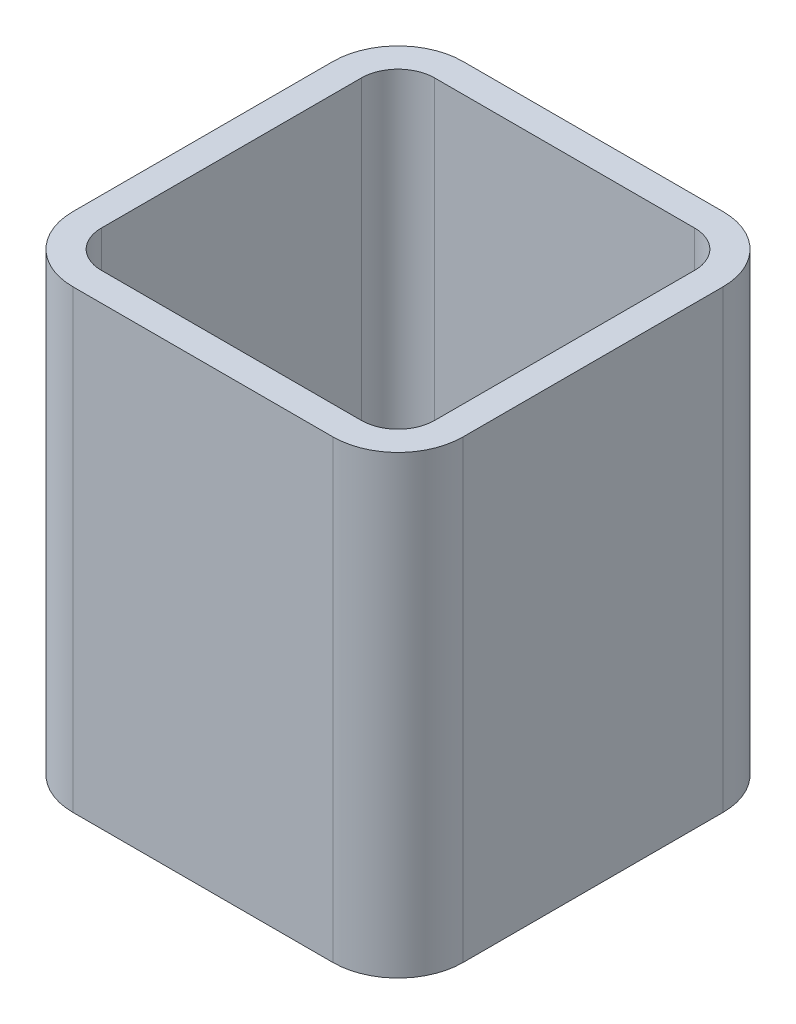
ISO-10303-21;
HEADER;
FILE_DESCRIPTION(('STEP AP214'),'2;1');
FILE_NAME('part.step','',(''),(''),'','','');
FILE_SCHEMA(('AUTOMOTIVE_DESIGN { 1 0 10303 214 1 1 1 1 }'));
ENDSEC;
DATA;
#1=APPLICATION_CONTEXT('core data for automotive mechanical design processes');
#2=APPLICATION_PROTOCOL_DEFINITION('international standard','automotive_design',2000,#1);
#3=PRODUCT_CONTEXT('',#1,'mechanical');
#4=PRODUCT('Part','Part','',(#3));
#5=PRODUCT_RELATED_PRODUCT_CATEGORY('part','',(#4));
#6=PRODUCT_DEFINITION_FORMATION('','',#4);
#7=PRODUCT_DEFINITION_CONTEXT('part definition',#1,'design');
#8=PRODUCT_DEFINITION('design','',#6,#7);
#9=PRODUCT_DEFINITION_SHAPE('','',#8);
#10=(LENGTH_UNIT() NAMED_UNIT(*) SI_UNIT(.MILLI.,.METRE.));
#11=(NAMED_UNIT(*) PLANE_ANGLE_UNIT() SI_UNIT($,.RADIAN.));
#12=(NAMED_UNIT(*) SI_UNIT($,.STERADIAN.) SOLID_ANGLE_UNIT());
#13=UNCERTAINTY_MEASURE_WITH_UNIT(LENGTH_MEASURE(1.E-05),#10,'distance_accuracy_value','');
#14=(GEOMETRIC_REPRESENTATION_CONTEXT(3) GLOBAL_UNCERTAINTY_ASSIGNED_CONTEXT((#13)) GLOBAL_UNIT_ASSIGNED_CONTEXT((#10,
#11,#12)) REPRESENTATION_CONTEXT('',''));
#15=CARTESIAN_POINT('',(0.,0.,0.));
#16=DIRECTION('',(0.,0.,1.));
#17=DIRECTION('',(1.,0.,0.));
#18=AXIS2_PLACEMENT_3D('',#15,#16,#17);
#19=CARTESIAN_POINT('',(101.6,355.6,-101.6));
#20=DIRECTION('',(0.,1.,0.));
#21=DIRECTION('',(0.,0.,1.));
#22=AXIS2_PLACEMENT_3D('',#19,#20,#21);
#23=PLANE('',#22);
#24=CARTESIAN_POINT('',(101.6,355.6,-101.6));
#25=DIRECTION('',(0.,1.,0.));
#26=DIRECTION('',(0.,0.,-1.));
#27=AXIS2_PLACEMENT_3D('',#24,#25,#26);
#28=CIRCLE('',#27,50.8);
#29=CARTESIAN_POINT('',(152.4,355.6,-101.6));
#30=VERTEX_POINT('',#29);
#31=CARTESIAN_POINT('',(101.6,355.6,-152.4));
#32=VERTEX_POINT('',#31);
#33=EDGE_CURVE('E290',#30,#32,#28,.T.);
#34=ORIENTED_EDGE('',*,*,#33,.T.);
#35=DIRECTION('',(-1.,0.,0.));
#36=VECTOR('',#35,1.);
#37=CARTESIAN_POINT('',(-101.6,355.6,-152.4));
#38=LINE('',#37,#36);
#39=CARTESIAN_POINT('',(-101.6,355.6,-152.4));
#40=VERTEX_POINT('',#39);
#41=EDGE_CURVE('E294',#32,#40,#38,.T.);
#42=ORIENTED_EDGE('',*,*,#41,.T.);
#43=CARTESIAN_POINT('',(-101.6,355.6,-101.6));
#44=DIRECTION('',(0.,1.,0.));
#45=DIRECTION('',(0.,0.,1.));
#46=AXIS2_PLACEMENT_3D('',#43,#44,#45);
#47=CIRCLE('',#46,50.8);
#48=CARTESIAN_POINT('',(-152.4,355.6,-101.6));
#49=VERTEX_POINT('',#48);
#50=EDGE_CURVE('E298',#40,#49,#47,.T.);
#51=ORIENTED_EDGE('',*,*,#50,.T.);
#52=DIRECTION('',(0.,0.,1.));
#53=VECTOR('',#52,1.);
#54=CARTESIAN_POINT('',(-152.4,355.6,-101.6));
#55=LINE('',#54,#53);
#56=CARTESIAN_POINT('',(-152.4,355.6,101.6));
#57=VERTEX_POINT('',#56);
#58=EDGE_CURVE('E301',#49,#57,#55,.T.);
#59=ORIENTED_EDGE('',*,*,#58,.T.);
#60=CARTESIAN_POINT('',(-101.6,355.6,101.6));
#61=DIRECTION('',(0.,1.,0.));
#62=DIRECTION('',(0.,0.,1.));
#63=AXIS2_PLACEMENT_3D('',#60,#61,#62);
#64=CIRCLE('',#63,50.8);
#65=CARTESIAN_POINT('',(-101.6,355.6,152.4));
#66=VERTEX_POINT('',#65);
#67=EDGE_CURVE('E304',#57,#66,#64,.T.);
#68=ORIENTED_EDGE('',*,*,#67,.T.);
#69=DIRECTION('',(1.,0.,0.));
#70=VECTOR('',#69,1.);
#71=CARTESIAN_POINT('',(-101.6,355.6,152.4));
#72=LINE('',#71,#70);
#73=CARTESIAN_POINT('',(101.6,355.6,152.4));
#74=VERTEX_POINT('',#73);
#75=EDGE_CURVE('E307',#66,#74,#72,.T.);
#76=ORIENTED_EDGE('',*,*,#75,.T.);
#77=CARTESIAN_POINT('',(101.6,355.6,101.6));
#78=DIRECTION('',(0.,1.,0.));
#79=DIRECTION('',(0.,0.,1.));
#80=AXIS2_PLACEMENT_3D('',#77,#78,#79);
#81=CIRCLE('',#80,50.8);
#82=CARTESIAN_POINT('',(152.4,355.6,101.6));
#83=VERTEX_POINT('',#82);
#84=EDGE_CURVE('E310',#74,#83,#81,.T.);
#85=ORIENTED_EDGE('',*,*,#84,.T.);
#86=DIRECTION('',(0.,0.,-1.));
#87=VECTOR('',#86,1.);
#88=CARTESIAN_POINT('',(152.4,355.6,-101.6));
#89=LINE('',#88,#87);
#90=EDGE_CURVE('E313',#83,#30,#89,.T.);
#91=ORIENTED_EDGE('',*,*,#90,.T.);
#92=EDGE_LOOP('',(#34,#42,#51,#59,#68,#76,#85,#91));
#93=FACE_BOUND('',#92,.T.);
#94=DIRECTION('',(-1.,0.,0.));
#95=VECTOR('',#94,1.);
#96=CARTESIAN_POINT('',(101.6,355.6,-130.175));
#97=LINE('',#96,#95);
#98=CARTESIAN_POINT('',(101.6,355.6,-130.175));
#99=VERTEX_POINT('',#98);
#100=CARTESIAN_POINT('',(-101.6,355.6,-130.175));
#101=VERTEX_POINT('',#100);
#102=EDGE_CURVE('E210',#99,#101,#97,.T.);
#103=ORIENTED_EDGE('',*,*,#102,.F.);
#104=CARTESIAN_POINT('',(101.6,355.6,-101.6));
#105=DIRECTION('',(0.,-1.,0.));
#106=DIRECTION('',(-1.,0.,0.));
#107=AXIS2_PLACEMENT_3D('',#104,#105,#106);
#108=CIRCLE('',#107,28.575);
#109=CARTESIAN_POINT('',(130.175,355.6,-101.6));
#110=VERTEX_POINT('',#109);
#111=EDGE_CURVE('E201',#110,#99,#108,.F.);
#112=ORIENTED_EDGE('',*,*,#111,.F.);
#113=DIRECTION('',(0.,0.,-1.));
#114=VECTOR('',#113,1.);
#115=CARTESIAN_POINT('',(130.175,355.6,-101.6));
#116=LINE('',#115,#114);
#117=CARTESIAN_POINT('',(130.175,355.6,101.6));
#118=VERTEX_POINT('',#117);
#119=EDGE_CURVE('E242',#118,#110,#116,.T.);
#120=ORIENTED_EDGE('',*,*,#119,.F.);
#121=CARTESIAN_POINT('',(101.6,355.6,101.6));
#122=DIRECTION('',(0.,-1.,0.));
#123=DIRECTION('',(-1.,0.,0.));
#124=AXIS2_PLACEMENT_3D('',#121,#122,#123);
#125=CIRCLE('',#124,28.575);
#126=CARTESIAN_POINT('',(101.6,355.6,130.175));
#127=VERTEX_POINT('',#126);
#128=EDGE_CURVE('E239',#127,#118,#125,.F.);
#129=ORIENTED_EDGE('',*,*,#128,.F.);
#130=DIRECTION('',(1.,0.,0.));
#131=VECTOR('',#130,1.);
#132=CARTESIAN_POINT('',(101.6,355.6,130.175));
#133=LINE('',#132,#131);
#134=CARTESIAN_POINT('',(-101.6,355.6,130.175));
#135=VERTEX_POINT('',#134);
#136=EDGE_CURVE('E236',#135,#127,#133,.T.);
#137=ORIENTED_EDGE('',*,*,#136,.F.);
#138=CARTESIAN_POINT('',(-101.6,355.6,101.6));
#139=DIRECTION('',(0.,-1.,0.));
#140=DIRECTION('',(-1.,0.,0.));
#141=AXIS2_PLACEMENT_3D('',#138,#139,#140);
#142=CIRCLE('',#141,28.575);
#143=CARTESIAN_POINT('',(-130.175,355.6,101.6));
#144=VERTEX_POINT('',#143);
#145=EDGE_CURVE('E233',#144,#135,#142,.F.);
#146=ORIENTED_EDGE('',*,*,#145,.F.);
#147=DIRECTION('',(0.,0.,1.));
#148=VECTOR('',#147,1.);
#149=CARTESIAN_POINT('',(-130.175,355.6,-101.6));
#150=LINE('',#149,#148);
#151=CARTESIAN_POINT('',(-130.175,355.6,-101.6));
#152=VERTEX_POINT('',#151);
#153=EDGE_CURVE('E228',#152,#144,#150,.T.);
#154=ORIENTED_EDGE('',*,*,#153,.F.);
#155=CARTESIAN_POINT('',(-101.6,355.6,-101.6));
#156=DIRECTION('',(0.,-1.,0.));
#157=DIRECTION('',(-1.,0.,0.));
#158=AXIS2_PLACEMENT_3D('',#155,#156,#157);
#159=CIRCLE('',#158,28.575);
#160=EDGE_CURVE('E224',#101,#152,#159,.F.);
#161=ORIENTED_EDGE('',*,*,#160,.F.);
#162=EDGE_LOOP('',(#103,#112,#120,#129,#137,#146,#154,#161));
#163=FACE_BOUND('',#162,.T.);
#164=ADVANCED_FACE('F87',(#93,#163),#23,.T.);
#165=CARTESIAN_POINT('',(101.6,0.,-101.6));
#166=DIRECTION('',(0.,1.,0.));
#167=DIRECTION('',(0.,0.,1.));
#168=AXIS2_PLACEMENT_3D('',#165,#166,#167);
#169=PLANE('',#168);
#170=CARTESIAN_POINT('',(101.6,0.,-101.6));
#171=DIRECTION('',(0.,1.,0.));
#172=DIRECTION('',(0.,0.,-1.));
#173=AXIS2_PLACEMENT_3D('',#170,#171,#172);
#174=CIRCLE('',#173,50.8);
#175=CARTESIAN_POINT('',(152.4,0.,-101.6));
#176=VERTEX_POINT('',#175);
#177=CARTESIAN_POINT('',(101.6,0.,-152.4));
#178=VERTEX_POINT('',#177);
#179=EDGE_CURVE('E219',#176,#178,#174,.T.);
#180=ORIENTED_EDGE('',*,*,#179,.F.);
#181=DIRECTION('',(0.,0.,-1.));
#182=VECTOR('',#181,1.);
#183=CARTESIAN_POINT('',(152.4,0.,-101.6));
#184=LINE('',#183,#182);
#185=CARTESIAN_POINT('',(152.4,0.,101.6));
#186=VERTEX_POINT('',#185);
#187=EDGE_CURVE('E295',#186,#176,#184,.T.);
#188=ORIENTED_EDGE('',*,*,#187,.F.);
#189=CARTESIAN_POINT('',(101.6,0.,101.6));
#190=DIRECTION('',(0.,1.,0.));
#191=DIRECTION('',(0.,0.,1.));
#192=AXIS2_PLACEMENT_3D('',#189,#190,#191);
#193=CIRCLE('',#192,50.8);
#194=CARTESIAN_POINT('',(101.6,0.,152.4));
#195=VERTEX_POINT('',#194);
#196=EDGE_CURVE('E335',#195,#186,#193,.T.);
#197=ORIENTED_EDGE('',*,*,#196,.F.);
#198=DIRECTION('',(1.,0.,0.));
#199=VECTOR('',#198,1.);
#200=CARTESIAN_POINT('',(-101.6,0.,152.4));
#201=LINE('',#200,#199);
#202=CARTESIAN_POINT('',(-101.6,0.,152.4));
#203=VERTEX_POINT('',#202);
#204=EDGE_CURVE('E332',#203,#195,#201,.T.);
#205=ORIENTED_EDGE('',*,*,#204,.F.);
#206=CARTESIAN_POINT('',(-101.6,0.,101.6));
#207=DIRECTION('',(0.,1.,0.));
#208=DIRECTION('',(0.,0.,1.));
#209=AXIS2_PLACEMENT_3D('',#206,#207,#208);
#210=CIRCLE('',#209,50.8);
#211=CARTESIAN_POINT('',(-152.4,0.,101.6));
#212=VERTEX_POINT('',#211);
#213=EDGE_CURVE('E329',#212,#203,#210,.T.);
#214=ORIENTED_EDGE('',*,*,#213,.F.);
#215=DIRECTION('',(0.,0.,1.));
#216=VECTOR('',#215,1.);
#217=CARTESIAN_POINT('',(-152.4,0.,-101.6));
#218=LINE('',#217,#216);
#219=CARTESIAN_POINT('',(-152.4,0.,-101.6));
#220=VERTEX_POINT('',#219);
#221=EDGE_CURVE('E326',#220,#212,#218,.T.);
#222=ORIENTED_EDGE('',*,*,#221,.F.);
#223=CARTESIAN_POINT('',(-101.6,0.,-101.6));
#224=DIRECTION('',(0.,1.,0.));
#225=DIRECTION('',(0.,0.,1.));
#226=AXIS2_PLACEMENT_3D('',#223,#224,#225);
#227=CIRCLE('',#226,50.8);
#228=CARTESIAN_POINT('',(-101.6,0.,-152.4));
#229=VERTEX_POINT('',#228);
#230=EDGE_CURVE('E323',#229,#220,#227,.T.);
#231=ORIENTED_EDGE('',*,*,#230,.F.);
#232=DIRECTION('',(-1.,0.,0.));
#233=VECTOR('',#232,1.);
#234=CARTESIAN_POINT('',(-101.6,0.,-152.4));
#235=LINE('',#234,#233);
#236=EDGE_CURVE('E320',#178,#229,#235,.T.);
#237=ORIENTED_EDGE('',*,*,#236,.F.);
#238=EDGE_LOOP('',(#180,#188,#197,#205,#214,#222,#231,#237));
#239=FACE_BOUND('',#238,.T.);
#240=CARTESIAN_POINT('',(101.6,0.,-101.6));
#241=DIRECTION('',(0.,-1.,0.));
#242=DIRECTION('',(-1.,0.,0.));
#243=AXIS2_PLACEMENT_3D('',#240,#241,#242);
#244=CIRCLE('',#243,28.575);
#245=CARTESIAN_POINT('',(130.175,0.,-101.6));
#246=VERTEX_POINT('',#245);
#247=CARTESIAN_POINT('',(101.6,0.,-130.175));
#248=VERTEX_POINT('',#247);
#249=EDGE_CURVE('E111',#246,#248,#244,.F.);
#250=ORIENTED_EDGE('',*,*,#249,.T.);
#251=DIRECTION('',(-1.,0.,0.));
#252=VECTOR('',#251,1.);
#253=CARTESIAN_POINT('',(101.6,0.,-130.175));
#254=LINE('',#253,#252);
#255=CARTESIAN_POINT('',(-101.6,0.,-130.175));
#256=VERTEX_POINT('',#255);
#257=EDGE_CURVE('E217',#248,#256,#254,.T.);
#258=ORIENTED_EDGE('',*,*,#257,.T.);
#259=CARTESIAN_POINT('',(-101.6,0.,-101.6));
#260=DIRECTION('',(0.,-1.,0.));
#261=DIRECTION('',(-1.,0.,0.));
#262=AXIS2_PLACEMENT_3D('',#259,#260,#261);
#263=CIRCLE('',#262,28.575);
#264=CARTESIAN_POINT('',(-130.175,0.,-101.6));
#265=VERTEX_POINT('',#264);
#266=EDGE_CURVE('E249',#256,#265,#263,.F.);
#267=ORIENTED_EDGE('',*,*,#266,.T.);
#268=DIRECTION('',(0.,0.,1.));
#269=VECTOR('',#268,1.);
#270=CARTESIAN_POINT('',(-130.175,0.,-101.6));
#271=LINE('',#270,#269);
#272=CARTESIAN_POINT('',(-130.175,0.,101.6));
#273=VERTEX_POINT('',#272);
#274=EDGE_CURVE('E253',#265,#273,#271,.T.);
#275=ORIENTED_EDGE('',*,*,#274,.T.);
#276=CARTESIAN_POINT('',(-101.6,0.,101.6));
#277=DIRECTION('',(0.,-1.,0.));
#278=DIRECTION('',(-1.,0.,0.));
#279=AXIS2_PLACEMENT_3D('',#276,#277,#278);
#280=CIRCLE('',#279,28.575);
#281=CARTESIAN_POINT('',(-101.6,0.,130.175));
#282=VERTEX_POINT('',#281);
#283=EDGE_CURVE('E257',#273,#282,#280,.F.);
#284=ORIENTED_EDGE('',*,*,#283,.T.);
#285=DIRECTION('',(1.,0.,0.));
#286=VECTOR('',#285,1.);
#287=CARTESIAN_POINT('',(101.6,0.,130.175));
#288=LINE('',#287,#286);
#289=CARTESIAN_POINT('',(101.6,0.,130.175));
#290=VERTEX_POINT('',#289);
#291=EDGE_CURVE('E261',#282,#290,#288,.T.);
#292=ORIENTED_EDGE('',*,*,#291,.T.);
#293=CARTESIAN_POINT('',(101.6,0.,101.6));
#294=DIRECTION('',(0.,-1.,0.));
#295=DIRECTION('',(-1.,0.,0.));
#296=AXIS2_PLACEMENT_3D('',#293,#294,#295);
#297=CIRCLE('',#296,28.575);
#298=CARTESIAN_POINT('',(130.175,0.,101.6));
#299=VERTEX_POINT('',#298);
#300=EDGE_CURVE('E265',#290,#299,#297,.F.);
#301=ORIENTED_EDGE('',*,*,#300,.T.);
#302=DIRECTION('',(0.,0.,-1.));
#303=VECTOR('',#302,1.);
#304=CARTESIAN_POINT('',(130.175,0.,-101.6));
#305=LINE('',#304,#303);
#306=EDGE_CURVE('E211',#299,#246,#305,.T.);
#307=ORIENTED_EDGE('',*,*,#306,.T.);
#308=EDGE_LOOP('',(#250,#258,#267,#275,#284,#292,#301,#307));
#309=FACE_BOUND('',#308,.T.);
#310=ADVANCED_FACE('F374',(#239,#309),#169,.F.);
#311=CARTESIAN_POINT('',(101.6,355.6,-101.6));
#312=DIRECTION('',(0.,-1.,0.));
#313=DIRECTION('',(0.,0.,-1.));
#314=AXIS2_PLACEMENT_3D('',#311,#312,#313);
#315=CYLINDRICAL_SURFACE('',#314,50.8);
#316=ORIENTED_EDGE('',*,*,#179,.T.);
#317=DIRECTION('',(0.,-1.,0.));
#318=VECTOR('',#317,1.);
#319=CARTESIAN_POINT('',(101.6,355.6,-152.4));
#320=LINE('',#319,#318);
#321=EDGE_CURVE('E12',#32,#178,#320,.T.);
#322=ORIENTED_EDGE('',*,*,#321,.F.);
#323=ORIENTED_EDGE('',*,*,#33,.F.);
#324=DIRECTION('',(0.,-1.,0.));
#325=VECTOR('',#324,1.);
#326=CARTESIAN_POINT('',(152.4,355.6,-101.6));
#327=LINE('',#326,#325);
#328=EDGE_CURVE('E316',#30,#176,#327,.T.);
#329=ORIENTED_EDGE('',*,*,#328,.T.);
#330=EDGE_LOOP('',(#316,#322,#323,#329));
#331=FACE_BOUND('',#330,.T.);
#332=ADVANCED_FACE('F89',(#331),#315,.T.);
#333=CARTESIAN_POINT('',(-101.6,355.6,-152.4));
#334=DIRECTION('',(0.,0.,1.));
#335=DIRECTION('',(1.,0.,0.));
#336=AXIS2_PLACEMENT_3D('',#333,#334,#335);
#337=PLANE('',#336);
#338=ORIENTED_EDGE('',*,*,#236,.T.);
#339=DIRECTION('',(0.,-1.,0.));
#340=VECTOR('',#339,1.);
#341=CARTESIAN_POINT('',(-101.6,355.6,-152.4));
#342=LINE('',#341,#340);
#343=EDGE_CURVE('E96',#40,#229,#342,.T.);
#344=ORIENTED_EDGE('',*,*,#343,.F.);
#345=ORIENTED_EDGE('',*,*,#41,.F.);
#346=ORIENTED_EDGE('',*,*,#321,.T.);
#347=EDGE_LOOP('',(#338,#344,#345,#346));
#348=FACE_BOUND('',#347,.T.);
#349=ADVANCED_FACE('F391',(#348),#337,.F.);
#350=CARTESIAN_POINT('',(-101.6,355.6,-101.6));
#351=DIRECTION('',(0.,-1.,0.));
#352=DIRECTION('',(0.,0.,-1.));
#353=AXIS2_PLACEMENT_3D('',#350,#351,#352);
#354=CYLINDRICAL_SURFACE('',#353,50.8);
#355=ORIENTED_EDGE('',*,*,#230,.T.);
#356=DIRECTION('',(0.,-1.,0.));
#357=VECTOR('',#356,1.);
#358=CARTESIAN_POINT('',(-152.4,355.6,-101.6));
#359=LINE('',#358,#357);
#360=EDGE_CURVE('E359',#49,#220,#359,.T.);
#361=ORIENTED_EDGE('',*,*,#360,.F.);
#362=ORIENTED_EDGE('',*,*,#50,.F.);
#363=ORIENTED_EDGE('',*,*,#343,.T.);
#364=EDGE_LOOP('',(#355,#361,#362,#363));
#365=FACE_BOUND('',#364,.T.);
#366=ADVANCED_FACE('F368',(#365),#354,.T.);
#367=CARTESIAN_POINT('',(-152.4,355.6,-101.6));
#368=DIRECTION('',(1.,0.,0.));
#369=DIRECTION('',(0.,0.,-1.));
#370=AXIS2_PLACEMENT_3D('',#367,#368,#369);
#371=PLANE('',#370);
#372=ORIENTED_EDGE('',*,*,#221,.T.);
#373=DIRECTION('',(0.,-1.,0.));
#374=VECTOR('',#373,1.);
#375=CARTESIAN_POINT('',(-152.4,355.6,101.6));
#376=LINE('',#375,#374);
#377=EDGE_CURVE('E355',#57,#212,#376,.T.);
#378=ORIENTED_EDGE('',*,*,#377,.F.);
#379=ORIENTED_EDGE('',*,*,#58,.F.);
#380=ORIENTED_EDGE('',*,*,#360,.T.);
#381=EDGE_LOOP('',(#372,#378,#379,#380));
#382=FACE_BOUND('',#381,.T.);
#383=ADVANCED_FACE('F380',(#382),#371,.F.);
#384=CARTESIAN_POINT('',(-101.6,355.6,101.6));
#385=DIRECTION('',(0.,-1.,0.));
#386=DIRECTION('',(0.,0.,-1.));
#387=AXIS2_PLACEMENT_3D('',#384,#385,#386);
#388=CYLINDRICAL_SURFACE('',#387,50.8);
#389=ORIENTED_EDGE('',*,*,#213,.T.);
#390=DIRECTION('',(0.,-1.,0.));
#391=VECTOR('',#390,1.);
#392=CARTESIAN_POINT('',(-101.6,355.6,152.4));
#393=LINE('',#392,#391);
#394=EDGE_CURVE('E351',#66,#203,#393,.T.);
#395=ORIENTED_EDGE('',*,*,#394,.F.);
#396=ORIENTED_EDGE('',*,*,#67,.F.);
#397=ORIENTED_EDGE('',*,*,#377,.T.);
#398=EDGE_LOOP('',(#389,#395,#396,#397));
#399=FACE_BOUND('',#398,.T.);
#400=ADVANCED_FACE('F384',(#399),#388,.T.);
#401=CARTESIAN_POINT('',(-101.6,355.6,152.4));
#402=DIRECTION('',(0.,0.,-1.));
#403=DIRECTION('',(-1.,0.,0.));
#404=AXIS2_PLACEMENT_3D('',#401,#402,#403);
#405=PLANE('',#404);
#406=ORIENTED_EDGE('',*,*,#204,.T.);
#407=DIRECTION('',(0.,-1.,0.));
#408=VECTOR('',#407,1.);
#409=CARTESIAN_POINT('',(101.6,355.6,152.4));
#410=LINE('',#409,#408);
#411=EDGE_CURVE('E347',#74,#195,#410,.T.);
#412=ORIENTED_EDGE('',*,*,#411,.F.);
#413=ORIENTED_EDGE('',*,*,#75,.F.);
#414=ORIENTED_EDGE('',*,*,#394,.T.);
#415=EDGE_LOOP('',(#406,#412,#413,#414));
#416=FACE_BOUND('',#415,.T.);
#417=ADVANCED_FACE('F404',(#416),#405,.F.);
#418=CARTESIAN_POINT('',(101.6,355.6,101.6));
#419=DIRECTION('',(0.,-1.,0.));
#420=DIRECTION('',(0.,0.,-1.));
#421=AXIS2_PLACEMENT_3D('',#418,#419,#420);
#422=CYLINDRICAL_SURFACE('',#421,50.8);
#423=ORIENTED_EDGE('',*,*,#196,.T.);
#424=DIRECTION('',(0.,-1.,0.));
#425=VECTOR('',#424,1.);
#426=CARTESIAN_POINT('',(152.4,355.6,101.6));
#427=LINE('',#426,#425);
#428=EDGE_CURVE('E343',#83,#186,#427,.T.);
#429=ORIENTED_EDGE('',*,*,#428,.F.);
#430=ORIENTED_EDGE('',*,*,#84,.F.);
#431=ORIENTED_EDGE('',*,*,#411,.T.);
#432=EDGE_LOOP('',(#423,#429,#430,#431));
#433=FACE_BOUND('',#432,.T.);
#434=ADVANCED_FACE('F402',(#433),#422,.T.);
#435=CARTESIAN_POINT('',(152.4,355.6,-101.6));
#436=DIRECTION('',(-1.,0.,0.));
#437=DIRECTION('',(0.,0.,1.));
#438=AXIS2_PLACEMENT_3D('',#435,#436,#437);
#439=PLANE('',#438);
#440=ORIENTED_EDGE('',*,*,#187,.T.);
#441=ORIENTED_EDGE('',*,*,#328,.F.);
#442=ORIENTED_EDGE('',*,*,#90,.F.);
#443=ORIENTED_EDGE('',*,*,#428,.T.);
#444=EDGE_LOOP('',(#440,#441,#442,#443));
#445=FACE_BOUND('',#444,.T.);
#446=ADVANCED_FACE('F397',(#445),#439,.F.);
#447=CARTESIAN_POINT('',(101.6,355.6,-101.6));
#448=DIRECTION('',(0.,-1.,0.));
#449=DIRECTION('',(0.,0.,-1.));
#450=AXIS2_PLACEMENT_3D('',#447,#448,#449);
#451=CYLINDRICAL_SURFACE('',#450,28.575);
#452=ORIENTED_EDGE('',*,*,#249,.F.);
#453=DIRECTION('',(0.,-1.,0.));
#454=VECTOR('',#453,1.);
#455=CARTESIAN_POINT('',(130.175,355.6,-101.6));
#456=LINE('',#455,#454);
#457=EDGE_CURVE('E205',#110,#246,#456,.T.);
#458=ORIENTED_EDGE('',*,*,#457,.F.);
#459=ORIENTED_EDGE('',*,*,#111,.T.);
#460=DIRECTION('',(0.,-1.,0.));
#461=VECTOR('',#460,1.);
#462=CARTESIAN_POINT('',(101.6,355.6,-130.175));
#463=LINE('',#462,#461);
#464=EDGE_CURVE('E204',#99,#248,#463,.T.);
#465=ORIENTED_EDGE('',*,*,#464,.T.);
#466=EDGE_LOOP('',(#452,#458,#459,#465));
#467=FACE_BOUND('',#466,.T.);
#468=ADVANCED_FACE('F203',(#467),#451,.F.);
#469=CARTESIAN_POINT('',(101.6,355.6,-130.175));
#470=DIRECTION('',(0.,0.,1.));
#471=DIRECTION('',(1.,0.,0.));
#472=AXIS2_PLACEMENT_3D('',#469,#470,#471);
#473=PLANE('',#472);
#474=ORIENTED_EDGE('',*,*,#257,.F.);
#475=ORIENTED_EDGE('',*,*,#464,.F.);
#476=ORIENTED_EDGE('',*,*,#102,.T.);
#477=DIRECTION('',(0.,-1.,0.));
#478=VECTOR('',#477,1.);
#479=CARTESIAN_POINT('',(-101.6,355.6,-130.175));
#480=LINE('',#479,#478);
#481=EDGE_CURVE('E220',#101,#256,#480,.T.);
#482=ORIENTED_EDGE('',*,*,#481,.T.);
#483=EDGE_LOOP('',(#474,#475,#476,#482));
#484=FACE_BOUND('',#483,.T.);
#485=ADVANCED_FACE('F214',(#484),#473,.T.);
#486=CARTESIAN_POINT('',(-101.6,355.6,-101.6));
#487=DIRECTION('',(0.,-1.,0.));
#488=DIRECTION('',(0.,0.,-1.));
#489=AXIS2_PLACEMENT_3D('',#486,#487,#488);
#490=CYLINDRICAL_SURFACE('',#489,28.575);
#491=ORIENTED_EDGE('',*,*,#266,.F.);
#492=ORIENTED_EDGE('',*,*,#481,.F.);
#493=ORIENTED_EDGE('',*,*,#160,.T.);
#494=DIRECTION('',(0.,-1.,0.));
#495=VECTOR('',#494,1.);
#496=CARTESIAN_POINT('',(-130.175,355.6,-101.6));
#497=LINE('',#496,#495);
#498=EDGE_CURVE('E285',#152,#265,#497,.T.);
#499=ORIENTED_EDGE('',*,*,#498,.T.);
#500=EDGE_LOOP('',(#491,#492,#493,#499));
#501=FACE_BOUND('',#500,.T.);
#502=ADVANCED_FACE('F429',(#501),#490,.F.);
#503=CARTESIAN_POINT('',(-130.175,355.6,-101.6));
#504=DIRECTION('',(1.,0.,0.));
#505=DIRECTION('',(0.,0.,-1.));
#506=AXIS2_PLACEMENT_3D('',#503,#504,#505);
#507=PLANE('',#506);
#508=ORIENTED_EDGE('',*,*,#274,.F.);
#509=ORIENTED_EDGE('',*,*,#498,.F.);
#510=ORIENTED_EDGE('',*,*,#153,.T.);
#511=DIRECTION('',(0.,-1.,0.));
#512=VECTOR('',#511,1.);
#513=CARTESIAN_POINT('',(-130.175,355.6,101.6));
#514=LINE('',#513,#512);
#515=EDGE_CURVE('E282',#144,#273,#514,.T.);
#516=ORIENTED_EDGE('',*,*,#515,.T.);
#517=EDGE_LOOP('',(#508,#509,#510,#516));
#518=FACE_BOUND('',#517,.T.);
#519=ADVANCED_FACE('F433',(#518),#507,.T.);
#520=CARTESIAN_POINT('',(-101.6,355.6,101.6));
#521=DIRECTION('',(0.,-1.,0.));
#522=DIRECTION('',(0.,0.,-1.));
#523=AXIS2_PLACEMENT_3D('',#520,#521,#522);
#524=CYLINDRICAL_SURFACE('',#523,28.575);
#525=ORIENTED_EDGE('',*,*,#283,.F.);
#526=ORIENTED_EDGE('',*,*,#515,.F.);
#527=ORIENTED_EDGE('',*,*,#145,.T.);
#528=DIRECTION('',(0.,-1.,0.));
#529=VECTOR('',#528,1.);
#530=CARTESIAN_POINT('',(-101.6,355.6,130.175));
#531=LINE('',#530,#529);
#532=EDGE_CURVE('E279',#135,#282,#531,.T.);
#533=ORIENTED_EDGE('',*,*,#532,.T.);
#534=EDGE_LOOP('',(#525,#526,#527,#533));
#535=FACE_BOUND('',#534,.T.);
#536=ADVANCED_FACE('F439',(#535),#524,.F.);
#537=CARTESIAN_POINT('',(101.6,355.6,130.175));
#538=DIRECTION('',(0.,0.,-1.));
#539=DIRECTION('',(-1.,0.,0.));
#540=AXIS2_PLACEMENT_3D('',#537,#538,#539);
#541=PLANE('',#540);
#542=ORIENTED_EDGE('',*,*,#291,.F.);
#543=ORIENTED_EDGE('',*,*,#532,.F.);
#544=ORIENTED_EDGE('',*,*,#136,.T.);
#545=DIRECTION('',(0.,-1.,0.));
#546=VECTOR('',#545,1.);
#547=CARTESIAN_POINT('',(101.6,355.6,130.175));
#548=LINE('',#547,#546);
#549=EDGE_CURVE('E276',#127,#290,#548,.T.);
#550=ORIENTED_EDGE('',*,*,#549,.T.);
#551=EDGE_LOOP('',(#542,#543,#544,#550));
#552=FACE_BOUND('',#551,.T.);
#553=ADVANCED_FACE('F443',(#552),#541,.T.);
#554=CARTESIAN_POINT('',(101.6,355.6,101.6));
#555=DIRECTION('',(0.,-1.,0.));
#556=DIRECTION('',(0.,0.,-1.));
#557=AXIS2_PLACEMENT_3D('',#554,#555,#556);
#558=CYLINDRICAL_SURFACE('',#557,28.575);
#559=ORIENTED_EDGE('',*,*,#300,.F.);
#560=ORIENTED_EDGE('',*,*,#549,.F.);
#561=ORIENTED_EDGE('',*,*,#128,.T.);
#562=DIRECTION('',(0.,-1.,0.));
#563=VECTOR('',#562,1.);
#564=CARTESIAN_POINT('',(130.175,355.6,101.6));
#565=LINE('',#564,#563);
#566=EDGE_CURVE('E103',#118,#299,#565,.T.);
#567=ORIENTED_EDGE('',*,*,#566,.T.);
#568=EDGE_LOOP('',(#559,#560,#561,#567));
#569=FACE_BOUND('',#568,.T.);
#570=ADVANCED_FACE('F447',(#569),#558,.F.);
#571=CARTESIAN_POINT('',(130.175,355.6,-101.6));
#572=DIRECTION('',(-1.,0.,0.));
#573=DIRECTION('',(0.,0.,1.));
#574=AXIS2_PLACEMENT_3D('',#571,#572,#573);
#575=PLANE('',#574);
#576=ORIENTED_EDGE('',*,*,#306,.F.);
#577=ORIENTED_EDGE('',*,*,#566,.F.);
#578=ORIENTED_EDGE('',*,*,#119,.T.);
#579=ORIENTED_EDGE('',*,*,#457,.T.);
#580=EDGE_LOOP('',(#576,#577,#578,#579));
#581=FACE_BOUND('',#580,.T.);
#582=ADVANCED_FACE('F451',(#581),#575,.T.);
#583=CLOSED_SHELL('',(#164,#310,#332,#349,#366,#383,#400,#417,#434,#446,#468,#485,#502,#519,
#536,#553,#570,#582));
#584=MANIFOLD_SOLID_BREP('B2',#583);
#585=ADVANCED_BREP_SHAPE_REPRESENTATION('',(#18,#584),#14);
#586=SHAPE_DEFINITION_REPRESENTATION(#9,#585);
ENDSEC;
END-ISO-10303-21;
